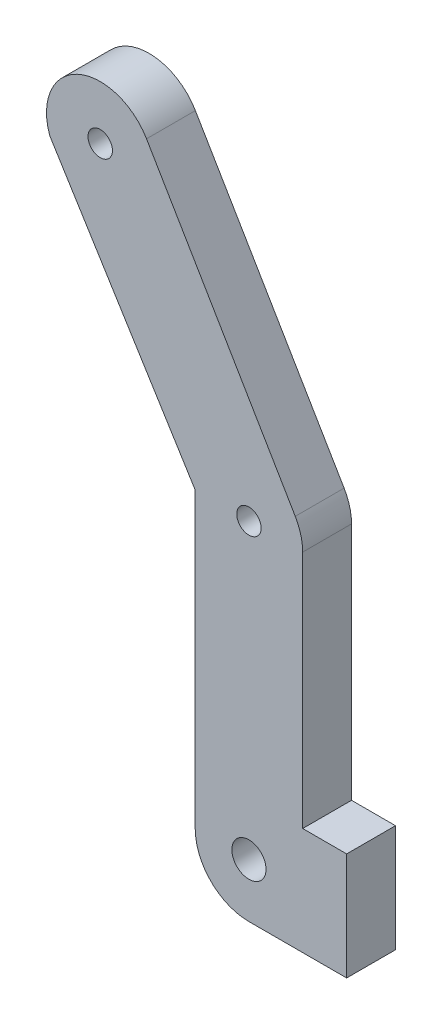
ISO-10303-21;
HEADER;
FILE_DESCRIPTION(('STEP AP214'),'2;1');
FILE_NAME('part.step','',(''),(''),'','','');
FILE_SCHEMA(('AUTOMOTIVE_DESIGN { 1 0 10303 214 1 1 1 1 }'));
ENDSEC;
DATA;
#1=APPLICATION_CONTEXT('core data for automotive mechanical design processes');
#2=APPLICATION_PROTOCOL_DEFINITION('international standard','automotive_design',2000,#1);
#3=PRODUCT_CONTEXT('',#1,'mechanical');
#4=PRODUCT('Part','Part','',(#3));
#5=PRODUCT_RELATED_PRODUCT_CATEGORY('part','',(#4));
#6=PRODUCT_DEFINITION_FORMATION('','',#4);
#7=PRODUCT_DEFINITION_CONTEXT('part definition',#1,'design');
#8=PRODUCT_DEFINITION('design','',#6,#7);
#9=PRODUCT_DEFINITION_SHAPE('','',#8);
#10=(LENGTH_UNIT() NAMED_UNIT(*) SI_UNIT(.MILLI.,.METRE.));
#11=(NAMED_UNIT(*) PLANE_ANGLE_UNIT() SI_UNIT($,.RADIAN.));
#12=(NAMED_UNIT(*) SI_UNIT($,.STERADIAN.) SOLID_ANGLE_UNIT());
#13=UNCERTAINTY_MEASURE_WITH_UNIT(LENGTH_MEASURE(1.E-05),#10,'distance_accuracy_value','');
#14=(GEOMETRIC_REPRESENTATION_CONTEXT(3) GLOBAL_UNCERTAINTY_ASSIGNED_CONTEXT((#13)) GLOBAL_UNIT_ASSIGNED_CONTEXT((#10,
#11,#12)) REPRESENTATION_CONTEXT('',''));
#15=CARTESIAN_POINT('',(0.,0.,0.));
#16=DIRECTION('',(0.,0.,1.));
#17=DIRECTION('',(1.,0.,0.));
#18=AXIS2_PLACEMENT_3D('',#15,#16,#17);
#19=CARTESIAN_POINT('',(370.235589605477,217.998398732449,5.));
#20=DIRECTION('',(0.861717729472851,0.507387972573409,0.));
#21=DIRECTION('',(-0.507387972573409,0.861717729472851,0.));
#22=AXIS2_PLACEMENT_3D('',#19,#20,#21);
#23=PLANE('',#22);
#24=DIRECTION('',(0.507387972573409,-0.861717729472851,0.));
#25=VECTOR('',#24,1.);
#26=CARTESIAN_POINT('',(370.235589605477,217.998398732449,0.));
#27=LINE('',#26,#25);
#28=CARTESIAN_POINT('',(258.753460649405,407.33305432862,0.));
#29=VERTEX_POINT('',#28);
#30=CARTESIAN_POINT('',(273.975099826607,381.481522444434,0.));
#31=VERTEX_POINT('',#30);
#32=EDGE_CURVE('E151',#29,#31,#27,.T.);
#33=ORIENTED_EDGE('',*,*,#32,.F.);
#34=DIRECTION('',(0.,0.,-1.));
#35=VECTOR('',#34,1.);
#36=CARTESIAN_POINT('',(258.753460649405,407.33305432862,5.));
#37=LINE('',#36,#35);
#38=CARTESIAN_POINT('',(258.753460649405,407.33305432862,5.));
#39=VERTEX_POINT('',#38);
#40=EDGE_CURVE('E11',#39,#29,#37,.T.);
#41=ORIENTED_EDGE('',*,*,#40,.F.);
#42=DIRECTION('',(0.507387972573409,-0.861717729472851,0.));
#43=VECTOR('',#42,1.);
#44=CARTESIAN_POINT('',(370.235589605477,217.998398732449,5.));
#45=LINE('',#44,#43);
#46=CARTESIAN_POINT('',(273.975099826607,381.481522444434,5.));
#47=VERTEX_POINT('',#46);
#48=EDGE_CURVE('E212',#39,#47,#45,.T.);
#49=ORIENTED_EDGE('',*,*,#48,.T.);
#50=DIRECTION('',(0.,0.,-1.));
#51=VECTOR('',#50,1.);
#52=CARTESIAN_POINT('',(273.975099826607,381.481522444434,5.));
#53=LINE('',#52,#51);
#54=EDGE_CURVE('E92',#47,#31,#53,.T.);
#55=ORIENTED_EDGE('',*,*,#54,.T.);
#56=EDGE_LOOP('',(#33,#41,#49,#55));
#57=FACE_BOUND('',#56,.T.);
#58=ADVANCED_FACE('F35',(#57),#23,.T.);
#59=CARTESIAN_POINT('',(254.014013137305,404.542420479466,5.));
#60=DIRECTION('',(0.,0.,-1.));
#61=DIRECTION('',(-1.,0.,0.));
#62=AXIS2_PLACEMENT_3D('',#59,#60,#61);
#63=CYLINDRICAL_SURFACE('',#62,5.50000000000001);
#64=CARTESIAN_POINT('',(254.014013137305,404.542420479466,0.));
#65=DIRECTION('',(0.,0.,1.));
#66=DIRECTION('',(1.,0.,0.));
#67=AXIS2_PLACEMENT_3D('',#64,#65,#66);
#68=CIRCLE('',#67,5.50000000000001);
#69=CARTESIAN_POINT('',(248.849842147484,402.649978145366,0.));
#70=VERTEX_POINT('',#69);
#71=EDGE_CURVE('E154',#29,#70,#68,.T.);
#72=ORIENTED_EDGE('',*,*,#71,.T.);
#73=DIRECTION('',(0.,0.,-1.));
#74=VECTOR('',#73,1.);
#75=CARTESIAN_POINT('',(248.849842147484,402.649978145366,5.));
#76=LINE('',#75,#74);
#77=CARTESIAN_POINT('',(248.849842147484,402.649978145366,5.));
#78=VERTEX_POINT('',#77);
#79=EDGE_CURVE('E44',#78,#70,#76,.T.);
#80=ORIENTED_EDGE('',*,*,#79,.F.);
#81=CARTESIAN_POINT('',(254.014013137305,404.542420479466,5.));
#82=DIRECTION('',(0.,0.,1.));
#83=DIRECTION('',(1.,0.,0.));
#84=AXIS2_PLACEMENT_3D('',#81,#82,#83);
#85=CIRCLE('',#84,5.50000000000001);
#86=EDGE_CURVE('E208',#39,#78,#85,.T.);
#87=ORIENTED_EDGE('',*,*,#86,.F.);
#88=ORIENTED_EDGE('',*,*,#40,.T.);
#89=EDGE_LOOP('',(#72,#80,#87,#88));
#90=FACE_BOUND('',#89,.T.);
#91=ADVANCED_FACE('F197',(#90),#63,.T.);
#92=CARTESIAN_POINT('',(360.037007722835,223.691411097295,5.));
#93=DIRECTION('',(-0.849407348524308,-0.527737772262802,0.));
#94=DIRECTION('',(0.527737772262802,-0.849407348524308,0.));
#95=AXIS2_PLACEMENT_3D('',#92,#93,#94);
#96=PLANE('',#95);
#97=DIRECTION('',(-0.527737772262803,0.849407348524308,0.));
#98=VECTOR('',#97,1.);
#99=CARTESIAN_POINT('',(360.037007722835,223.691411097295,0.));
#100=LINE('',#99,#98);
#101=CARTESIAN_POINT('',(263.735652314507,378.690888595281,0.));
#102=VERTEX_POINT('',#101);
#103=EDGE_CURVE('E157',#102,#70,#100,.T.);
#104=ORIENTED_EDGE('',*,*,#103,.F.);
#105=DIRECTION('',(0.,0.,-1.));
#106=VECTOR('',#105,1.);
#107=CARTESIAN_POINT('',(263.735652314507,378.690888595281,5.));
#108=LINE('',#107,#106);
#109=CARTESIAN_POINT('',(263.735652314507,378.690888595281,5.));
#110=VERTEX_POINT('',#109);
#111=EDGE_CURVE('E187',#110,#102,#108,.T.);
#112=ORIENTED_EDGE('',*,*,#111,.F.);
#113=DIRECTION('',(-0.527737772262803,0.849407348524308,0.));
#114=VECTOR('',#113,1.);
#115=CARTESIAN_POINT('',(360.037007722835,223.691411097295,5.));
#116=LINE('',#115,#114);
#117=EDGE_CURVE('E194',#110,#78,#116,.T.);
#118=ORIENTED_EDGE('',*,*,#117,.T.);
#119=ORIENTED_EDGE('',*,*,#79,.T.);
#120=EDGE_LOOP('',(#104,#112,#118,#119));
#121=FACE_BOUND('',#120,.T.);
#122=ADVANCED_FACE('F192',(#121),#96,.T.);
#123=CARTESIAN_POINT('',(263.735652314507,0.,5.));
#124=DIRECTION('',(-1.,0.,0.));
#125=DIRECTION('',(0.,0.,1.));
#126=AXIS2_PLACEMENT_3D('',#123,#124,#125);
#127=PLANE('',#126);
#128=DIRECTION('',(0.,1.,0.));
#129=VECTOR('',#128,1.);
#130=CARTESIAN_POINT('',(263.735652314507,0.,0.));
#131=LINE('',#130,#129);
#132=CARTESIAN_POINT('',(263.735652314507,348.69088859528,0.));
#133=VERTEX_POINT('',#132);
#134=EDGE_CURVE('E160',#133,#102,#131,.T.);
#135=ORIENTED_EDGE('',*,*,#134,.F.);
#136=DIRECTION('',(0.,0.,-1.));
#137=VECTOR('',#136,1.);
#138=CARTESIAN_POINT('',(263.735652314507,348.69088859528,5.));
#139=LINE('',#138,#137);
#140=CARTESIAN_POINT('',(263.735652314507,348.69088859528,5.));
#141=VERTEX_POINT('',#140);
#142=EDGE_CURVE('E185',#141,#133,#139,.T.);
#143=ORIENTED_EDGE('',*,*,#142,.F.);
#144=DIRECTION('',(0.,1.,0.));
#145=VECTOR('',#144,1.);
#146=CARTESIAN_POINT('',(263.735652314507,0.,5.));
#147=LINE('',#146,#145);
#148=EDGE_CURVE('E207',#141,#110,#147,.T.);
#149=ORIENTED_EDGE('',*,*,#148,.T.);
#150=ORIENTED_EDGE('',*,*,#111,.T.);
#151=EDGE_LOOP('',(#135,#143,#149,#150));
#152=FACE_BOUND('',#151,.T.);
#153=ADVANCED_FACE('F203',(#152),#127,.T.);
#154=CARTESIAN_POINT('',(269.235652314507,348.69088859528,5.));
#155=DIRECTION('',(0.,0.,-1.));
#156=DIRECTION('',(-1.,0.,0.));
#157=AXIS2_PLACEMENT_3D('',#154,#155,#156);
#158=CYLINDRICAL_SURFACE('',#157,5.50000000000001);
#159=CARTESIAN_POINT('',(269.235652314507,348.69088859528,0.));
#160=DIRECTION('',(0.,0.,1.));
#161=DIRECTION('',(1.,0.,0.));
#162=AXIS2_PLACEMENT_3D('',#159,#160,#161);
#163=CIRCLE('',#162,5.50000000000001);
#164=CARTESIAN_POINT('',(269.235652314507,343.19088859528,0.));
#165=VERTEX_POINT('',#164);
#166=EDGE_CURVE('E163',#133,#165,#163,.T.);
#167=ORIENTED_EDGE('',*,*,#166,.T.);
#168=DIRECTION('',(0.,0.,-1.));
#169=VECTOR('',#168,1.);
#170=CARTESIAN_POINT('',(269.235652314507,343.19088859528,5.));
#171=LINE('',#170,#169);
#172=CARTESIAN_POINT('',(269.235652314507,343.19088859528,5.));
#173=VERTEX_POINT('',#172);
#174=EDGE_CURVE('E183',#173,#165,#171,.T.);
#175=ORIENTED_EDGE('',*,*,#174,.F.);
#176=CARTESIAN_POINT('',(269.235652314507,348.69088859528,5.));
#177=DIRECTION('',(0.,0.,1.));
#178=DIRECTION('',(1.,0.,0.));
#179=AXIS2_PLACEMENT_3D('',#176,#177,#178);
#180=CIRCLE('',#179,5.50000000000001);
#181=EDGE_CURVE('E210',#141,#173,#180,.T.);
#182=ORIENTED_EDGE('',*,*,#181,.F.);
#183=ORIENTED_EDGE('',*,*,#142,.T.);
#184=EDGE_LOOP('',(#167,#175,#182,#183));
#185=FACE_BOUND('',#184,.T.);
#186=ADVANCED_FACE('F286',(#185),#158,.T.);
#187=CARTESIAN_POINT('',(0.,343.19088859528,5.));
#188=DIRECTION('',(0.,-1.,0.));
#189=DIRECTION('',(0.,0.,-1.));
#190=AXIS2_PLACEMENT_3D('',#187,#188,#189);
#191=PLANE('',#190);
#192=DIRECTION('',(-1.,0.,0.));
#193=VECTOR('',#192,1.);
#194=CARTESIAN_POINT('',(0.,343.19088859528,0.));
#195=LINE('',#194,#193);
#196=CARTESIAN_POINT('',(279.235652314507,343.19088859528,0.));
#197=VERTEX_POINT('',#196);
#198=EDGE_CURVE('E166',#197,#165,#195,.T.);
#199=ORIENTED_EDGE('',*,*,#198,.F.);
#200=DIRECTION('',(0.,0.,-1.));
#201=VECTOR('',#200,1.);
#202=CARTESIAN_POINT('',(279.235652314507,343.19088859528,5.));
#203=LINE('',#202,#201);
#204=CARTESIAN_POINT('',(279.235652314507,343.19088859528,5.));
#205=VERTEX_POINT('',#204);
#206=EDGE_CURVE('E181',#205,#197,#203,.T.);
#207=ORIENTED_EDGE('',*,*,#206,.F.);
#208=DIRECTION('',(-1.,0.,0.));
#209=VECTOR('',#208,1.);
#210=CARTESIAN_POINT('',(0.,343.19088859528,5.));
#211=LINE('',#210,#209);
#212=EDGE_CURVE('E217',#205,#173,#211,.T.);
#213=ORIENTED_EDGE('',*,*,#212,.T.);
#214=ORIENTED_EDGE('',*,*,#174,.T.);
#215=EDGE_LOOP('',(#199,#207,#213,#214));
#216=FACE_BOUND('',#215,.T.);
#217=ADVANCED_FACE('F283',(#216),#191,.T.);
#218=CARTESIAN_POINT('',(279.235652314507,0.,5.));
#219=DIRECTION('',(1.,0.,0.));
#220=DIRECTION('',(0.,0.,-1.));
#221=AXIS2_PLACEMENT_3D('',#218,#219,#220);
#222=PLANE('',#221);
#223=DIRECTION('',(0.,-1.,0.));
#224=VECTOR('',#223,1.);
#225=CARTESIAN_POINT('',(279.235652314507,0.,0.));
#226=LINE('',#225,#224);
#227=CARTESIAN_POINT('',(279.235652314507,354.19088859528,0.));
#228=VERTEX_POINT('',#227);
#229=EDGE_CURVE('E169',#228,#197,#226,.T.);
#230=ORIENTED_EDGE('',*,*,#229,.F.);
#231=DIRECTION('',(0.,0.,-1.));
#232=VECTOR('',#231,1.);
#233=CARTESIAN_POINT('',(279.235652314507,354.19088859528,5.));
#234=LINE('',#233,#232);
#235=CARTESIAN_POINT('',(279.235652314507,354.19088859528,5.));
#236=VERTEX_POINT('',#235);
#237=EDGE_CURVE('E128',#236,#228,#234,.T.);
#238=ORIENTED_EDGE('',*,*,#237,.F.);
#239=DIRECTION('',(0.,-1.,0.));
#240=VECTOR('',#239,1.);
#241=CARTESIAN_POINT('',(279.235652314507,0.,5.));
#242=LINE('',#241,#240);
#243=EDGE_CURVE('E135',#236,#205,#242,.T.);
#244=ORIENTED_EDGE('',*,*,#243,.T.);
#245=ORIENTED_EDGE('',*,*,#206,.T.);
#246=EDGE_LOOP('',(#230,#238,#244,#245));
#247=FACE_BOUND('',#246,.T.);
#248=ADVANCED_FACE('F221',(#247),#222,.T.);
#249=CARTESIAN_POINT('',(0.,354.19088859528,5.));
#250=DIRECTION('',(0.,1.,0.));
#251=DIRECTION('',(0.,0.,1.));
#252=AXIS2_PLACEMENT_3D('',#249,#250,#251);
#253=PLANE('',#252);
#254=DIRECTION('',(1.,0.,0.));
#255=VECTOR('',#254,1.);
#256=CARTESIAN_POINT('',(0.,354.19088859528,0.));
#257=LINE('',#256,#255);
#258=CARTESIAN_POINT('',(274.735652314507,354.19088859528,0.));
#259=VERTEX_POINT('',#258);
#260=EDGE_CURVE('E123',#259,#228,#257,.T.);
#261=ORIENTED_EDGE('',*,*,#260,.F.);
#262=DIRECTION('',(0.,0.,-1.));
#263=VECTOR('',#262,1.);
#264=CARTESIAN_POINT('',(274.735652314507,354.19088859528,5.));
#265=LINE('',#264,#263);
#266=CARTESIAN_POINT('',(274.735652314507,354.19088859528,5.));
#267=VERTEX_POINT('',#266);
#268=EDGE_CURVE('E118',#267,#259,#265,.T.);
#269=ORIENTED_EDGE('',*,*,#268,.F.);
#270=DIRECTION('',(1.,0.,0.));
#271=VECTOR('',#270,1.);
#272=CARTESIAN_POINT('',(0.,354.19088859528,5.));
#273=LINE('',#272,#271);
#274=EDGE_CURVE('E121',#267,#236,#273,.T.);
#275=ORIENTED_EDGE('',*,*,#274,.T.);
#276=ORIENTED_EDGE('',*,*,#237,.T.);
#277=EDGE_LOOP('',(#261,#269,#275,#276));
#278=FACE_BOUND('',#277,.T.);
#279=ADVANCED_FACE('F120',(#278),#253,.T.);
#280=CARTESIAN_POINT('',(274.735652314507,0.,5.));
#281=DIRECTION('',(1.,0.,0.));
#282=DIRECTION('',(0.,0.,-1.));
#283=AXIS2_PLACEMENT_3D('',#280,#281,#282);
#284=PLANE('',#283);
#285=DIRECTION('',(0.,-1.,0.));
#286=VECTOR('',#285,1.);
#287=CARTESIAN_POINT('',(274.735652314507,0.,0.));
#288=LINE('',#287,#286);
#289=CARTESIAN_POINT('',(274.735652314507,378.690888595281,0.));
#290=VERTEX_POINT('',#289);
#291=EDGE_CURVE('E173',#290,#259,#288,.T.);
#292=ORIENTED_EDGE('',*,*,#291,.F.);
#293=DIRECTION('',(0.,0.,-1.));
#294=VECTOR('',#293,1.);
#295=CARTESIAN_POINT('',(274.735652314507,378.690888595281,5.));
#296=LINE('',#295,#294);
#297=CARTESIAN_POINT('',(274.735652314507,378.690888595281,5.));
#298=VERTEX_POINT('',#297);
#299=EDGE_CURVE('E85',#298,#290,#296,.T.);
#300=ORIENTED_EDGE('',*,*,#299,.F.);
#301=DIRECTION('',(0.,-1.,0.));
#302=VECTOR('',#301,1.);
#303=CARTESIAN_POINT('',(274.735652314507,0.,5.));
#304=LINE('',#303,#302);
#305=EDGE_CURVE('E132',#298,#267,#304,.T.);
#306=ORIENTED_EDGE('',*,*,#305,.T.);
#307=ORIENTED_EDGE('',*,*,#268,.T.);
#308=EDGE_LOOP('',(#292,#300,#306,#307));
#309=FACE_BOUND('',#308,.T.);
#310=ADVANCED_FACE('F137',(#309),#284,.T.);
#311=CARTESIAN_POINT('',(269.235652314507,348.69088859528,5.));
#312=DIRECTION('',(0.,0.,-1.));
#313=DIRECTION('',(-1.,0.,0.));
#314=AXIS2_PLACEMENT_3D('',#311,#312,#313);
#315=CYLINDRICAL_SURFACE('',#314,1.74999999999998);
#316=CARTESIAN_POINT('',(269.235652314507,348.69088859528,5.));
#317=DIRECTION('',(0.,0.,1.));
#318=DIRECTION('',(1.,0.,0.));
#319=AXIS2_PLACEMENT_3D('',#316,#317,#318);
#320=CIRCLE('',#319,1.74999999999998);
#321=CARTESIAN_POINT('',(270.985652314507,348.69088859528,5.));
#322=VERTEX_POINT('',#321);
#323=EDGE_CURVE('E224',#322,#322,#320,.T.);
#324=ORIENTED_EDGE('',*,*,#323,.T.);
#325=EDGE_LOOP('',(#324));
#326=FACE_BOUND('',#325,.T.);
#327=CARTESIAN_POINT('',(269.235652314507,348.69088859528,0.));
#328=DIRECTION('',(0.,0.,1.));
#329=DIRECTION('',(1.,0.,0.));
#330=AXIS2_PLACEMENT_3D('',#327,#328,#329);
#331=CIRCLE('',#330,1.74999999999998);
#332=CARTESIAN_POINT('',(270.985652314507,348.69088859528,0.));
#333=VERTEX_POINT('',#332);
#334=EDGE_CURVE('E148',#333,#333,#331,.T.);
#335=ORIENTED_EDGE('',*,*,#334,.F.);
#336=EDGE_LOOP('',(#335));
#337=FACE_BOUND('',#336,.T.);
#338=ADVANCED_FACE('F243',(#326,#337),#315,.F.);
#339=CARTESIAN_POINT('',(269.235652314507,378.690888595281,5.));
#340=DIRECTION('',(0.,0.,-1.));
#341=DIRECTION('',(-1.,0.,0.));
#342=AXIS2_PLACEMENT_3D('',#339,#340,#341);
#343=CYLINDRICAL_SURFACE('',#342,1.25000000000001);
#344=CARTESIAN_POINT('',(269.235652314507,378.690888595281,5.));
#345=DIRECTION('',(0.,0.,1.));
#346=DIRECTION('',(1.,0.,0.));
#347=AXIS2_PLACEMENT_3D('',#344,#345,#346);
#348=CIRCLE('',#347,1.25000000000001);
#349=CARTESIAN_POINT('',(270.485652314507,378.690888595281,5.));
#350=VERTEX_POINT('',#349);
#351=EDGE_CURVE('E226',#350,#350,#348,.T.);
#352=ORIENTED_EDGE('',*,*,#351,.T.);
#353=EDGE_LOOP('',(#352));
#354=FACE_BOUND('',#353,.T.);
#355=CARTESIAN_POINT('',(269.235652314507,378.690888595281,0.));
#356=DIRECTION('',(0.,0.,1.));
#357=DIRECTION('',(1.,0.,0.));
#358=AXIS2_PLACEMENT_3D('',#355,#356,#357);
#359=CIRCLE('',#358,1.25000000000001);
#360=CARTESIAN_POINT('',(270.485652314507,378.690888595281,0.));
#361=VERTEX_POINT('',#360);
#362=EDGE_CURVE('E145',#361,#361,#359,.T.);
#363=ORIENTED_EDGE('',*,*,#362,.F.);
#364=EDGE_LOOP('',(#363));
#365=FACE_BOUND('',#364,.T.);
#366=ADVANCED_FACE('F246',(#354,#365),#343,.F.);
#367=CARTESIAN_POINT('',(254.014013137305,404.542420479466,5.));
#368=DIRECTION('',(0.,0.,-1.));
#369=DIRECTION('',(-1.,0.,0.));
#370=AXIS2_PLACEMENT_3D('',#367,#368,#369);
#371=CYLINDRICAL_SURFACE('',#370,1.24999999999996);
#372=CARTESIAN_POINT('',(254.014013137305,404.542420479466,5.));
#373=DIRECTION('',(0.,0.,1.));
#374=DIRECTION('',(1.,0.,0.));
#375=AXIS2_PLACEMENT_3D('',#372,#373,#374);
#376=CIRCLE('',#375,1.24999999999996);
#377=CARTESIAN_POINT('',(255.264013137305,404.542420479466,5.));
#378=VERTEX_POINT('',#377);
#379=EDGE_CURVE('E177',#378,#378,#376,.T.);
#380=ORIENTED_EDGE('',*,*,#379,.T.);
#381=EDGE_LOOP('',(#380));
#382=FACE_BOUND('',#381,.T.);
#383=CARTESIAN_POINT('',(254.014013137305,404.542420479466,0.));
#384=DIRECTION('',(0.,0.,1.));
#385=DIRECTION('',(1.,0.,0.));
#386=AXIS2_PLACEMENT_3D('',#383,#384,#385);
#387=CIRCLE('',#386,1.24999999999996);
#388=CARTESIAN_POINT('',(255.264013137305,404.542420479466,0.));
#389=VERTEX_POINT('',#388);
#390=EDGE_CURVE('E142',#389,#389,#387,.T.);
#391=ORIENTED_EDGE('',*,*,#390,.F.);
#392=EDGE_LOOP('',(#391));
#393=FACE_BOUND('',#392,.T.);
#394=ADVANCED_FACE('F37',(#382,#393),#371,.F.);
#395=CARTESIAN_POINT('',(269.235652314507,378.690888595281,5.));
#396=DIRECTION('',(0.,0.,-1.));
#397=DIRECTION('',(-1.,0.,0.));
#398=AXIS2_PLACEMENT_3D('',#395,#396,#397);
#399=CYLINDRICAL_SURFACE('',#398,5.50000000000001);
#400=CARTESIAN_POINT('',(269.235652314507,378.690888595281,0.));
#401=DIRECTION('',(0.,0.,1.));
#402=DIRECTION('',(1.,0.,0.));
#403=AXIS2_PLACEMENT_3D('',#400,#401,#402);
#404=CIRCLE('',#403,5.50000000000001);
#405=EDGE_CURVE('E175',#290,#31,#404,.T.);
#406=ORIENTED_EDGE('',*,*,#405,.T.);
#407=ORIENTED_EDGE('',*,*,#54,.F.);
#408=CARTESIAN_POINT('',(269.235652314507,378.690888595281,5.));
#409=DIRECTION('',(0.,0.,1.));
#410=DIRECTION('',(1.,0.,0.));
#411=AXIS2_PLACEMENT_3D('',#408,#409,#410);
#412=CIRCLE('',#411,5.50000000000001);
#413=EDGE_CURVE('E52',#298,#47,#412,.T.);
#414=ORIENTED_EDGE('',*,*,#413,.F.);
#415=ORIENTED_EDGE('',*,*,#299,.T.);
#416=EDGE_LOOP('',(#406,#407,#414,#415));
#417=FACE_BOUND('',#416,.T.);
#418=ADVANCED_FACE('F223',(#417),#399,.T.);
#419=CARTESIAN_POINT('',(0.,0.,5.));
#420=DIRECTION('',(0.,0.,1.));
#421=DIRECTION('',(1.,0.,0.));
#422=AXIS2_PLACEMENT_3D('',#419,#420,#421);
#423=PLANE('',#422);
#424=ORIENTED_EDGE('',*,*,#379,.F.);
#425=EDGE_LOOP('',(#424));
#426=FACE_BOUND('',#425,.T.);
#427=ORIENTED_EDGE('',*,*,#351,.F.);
#428=EDGE_LOOP('',(#427));
#429=FACE_BOUND('',#428,.T.);
#430=ORIENTED_EDGE('',*,*,#323,.F.);
#431=EDGE_LOOP('',(#430));
#432=FACE_BOUND('',#431,.T.);
#433=ORIENTED_EDGE('',*,*,#48,.F.);
#434=ORIENTED_EDGE('',*,*,#86,.T.);
#435=ORIENTED_EDGE('',*,*,#117,.F.);
#436=ORIENTED_EDGE('',*,*,#148,.F.);
#437=ORIENTED_EDGE('',*,*,#181,.T.);
#438=ORIENTED_EDGE('',*,*,#212,.F.);
#439=ORIENTED_EDGE('',*,*,#243,.F.);
#440=ORIENTED_EDGE('',*,*,#274,.F.);
#441=ORIENTED_EDGE('',*,*,#305,.F.);
#442=ORIENTED_EDGE('',*,*,#413,.T.);
#443=EDGE_LOOP('',(#433,#434,#435,#436,#437,#438,#439,#440,#441,#442));
#444=FACE_BOUND('',#443,.T.);
#445=ADVANCED_FACE('F131',(#426,#429,#432,#444),#423,.T.);
#446=CARTESIAN_POINT('',(0.,0.,0.));
#447=DIRECTION('',(0.,0.,1.));
#448=DIRECTION('',(1.,0.,0.));
#449=AXIS2_PLACEMENT_3D('',#446,#447,#448);
#450=PLANE('',#449);
#451=ORIENTED_EDGE('',*,*,#390,.T.);
#452=EDGE_LOOP('',(#451));
#453=FACE_BOUND('',#452,.T.);
#454=ORIENTED_EDGE('',*,*,#362,.T.);
#455=EDGE_LOOP('',(#454));
#456=FACE_BOUND('',#455,.T.);
#457=ORIENTED_EDGE('',*,*,#334,.T.);
#458=EDGE_LOOP('',(#457));
#459=FACE_BOUND('',#458,.T.);
#460=ORIENTED_EDGE('',*,*,#32,.T.);
#461=ORIENTED_EDGE('',*,*,#405,.F.);
#462=ORIENTED_EDGE('',*,*,#291,.T.);
#463=ORIENTED_EDGE('',*,*,#260,.T.);
#464=ORIENTED_EDGE('',*,*,#229,.T.);
#465=ORIENTED_EDGE('',*,*,#198,.T.);
#466=ORIENTED_EDGE('',*,*,#166,.F.);
#467=ORIENTED_EDGE('',*,*,#134,.T.);
#468=ORIENTED_EDGE('',*,*,#103,.T.);
#469=ORIENTED_EDGE('',*,*,#71,.F.);
#470=EDGE_LOOP('',(#460,#461,#462,#463,#464,#465,#466,#467,#468,#469));
#471=FACE_BOUND('',#470,.T.);
#472=ADVANCED_FACE('F199',(#453,#456,#459,#471),#450,.F.);
#473=CLOSED_SHELL('',(#58,#91,#122,#153,#186,#217,#248,#279,#310,#338,#366,#394,#418,#445,#472));
#474=MANIFOLD_SOLID_BREP('B2',#473);
#475=ADVANCED_BREP_SHAPE_REPRESENTATION('',(#18,#474),#14);
#476=SHAPE_DEFINITION_REPRESENTATION(#9,#475);
ENDSEC;
END-ISO-10303-21;
